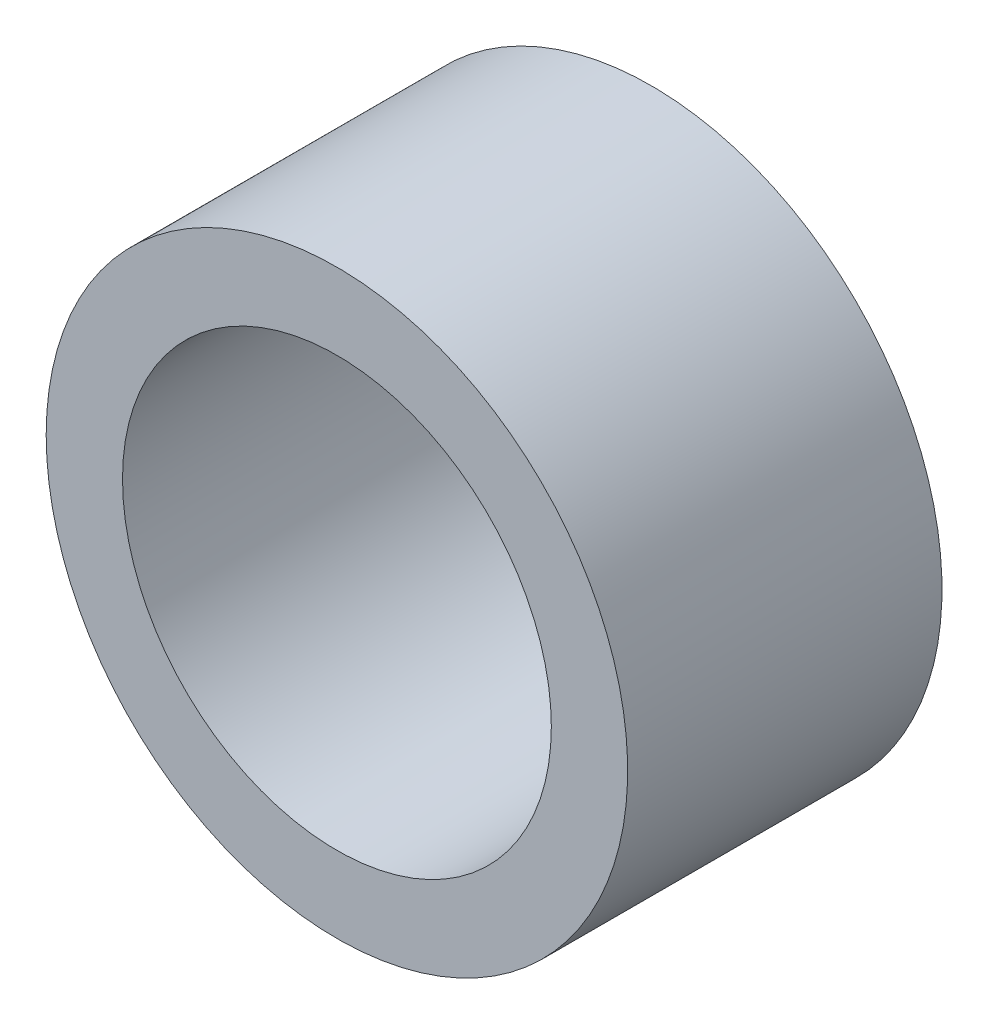
ISO-10303-21;
HEADER;
FILE_DESCRIPTION(('STEP AP214'),'2;1');
FILE_NAME('part.step','',(''),(''),'','','');
FILE_SCHEMA(('AUTOMOTIVE_DESIGN { 1 0 10303 214 1 1 1 1 }'));
ENDSEC;
DATA;
#1=APPLICATION_CONTEXT('core data for automotive mechanical design processes');
#2=APPLICATION_PROTOCOL_DEFINITION('international standard','automotive_design',2000,#1);
#3=PRODUCT_CONTEXT('',#1,'mechanical');
#4=PRODUCT('Part','Part','',(#3));
#5=PRODUCT_RELATED_PRODUCT_CATEGORY('part','',(#4));
#6=PRODUCT_DEFINITION_FORMATION('','',#4);
#7=PRODUCT_DEFINITION_CONTEXT('part definition',#1,'design');
#8=PRODUCT_DEFINITION('design','',#6,#7);
#9=PRODUCT_DEFINITION_SHAPE('','',#8);
#10=(LENGTH_UNIT() NAMED_UNIT(*) SI_UNIT(.MILLI.,.METRE.));
#11=(NAMED_UNIT(*) PLANE_ANGLE_UNIT() SI_UNIT($,.RADIAN.));
#12=(NAMED_UNIT(*) SI_UNIT($,.STERADIAN.) SOLID_ANGLE_UNIT());
#13=UNCERTAINTY_MEASURE_WITH_UNIT(LENGTH_MEASURE(1.E-05),#10,'distance_accuracy_value','');
#14=(GEOMETRIC_REPRESENTATION_CONTEXT(3) GLOBAL_UNCERTAINTY_ASSIGNED_CONTEXT((#13)) GLOBAL_UNIT_ASSIGNED_CONTEXT((#10,
#11,#12)) REPRESENTATION_CONTEXT('',''));
#15=CARTESIAN_POINT('',(0.,0.,0.));
#16=DIRECTION('',(0.,0.,1.));
#17=DIRECTION('',(1.,0.,0.));
#18=AXIS2_PLACEMENT_3D('',#15,#16,#17);
#19=CARTESIAN_POINT('',(0.,0.,7.112));
#20=DIRECTION('',(0.,0.,-1.));
#21=DIRECTION('',(-1.,0.,0.));
#22=AXIS2_PLACEMENT_3D('',#19,#20,#21);
#23=CYLINDRICAL_SURFACE('',#22,4.8514);
#24=CARTESIAN_POINT('',(0.,0.,0.));
#25=DIRECTION('',(0.,0.,-1.));
#26=DIRECTION('',(-1.,0.,0.));
#27=AXIS2_PLACEMENT_3D('',#24,#25,#26);
#28=CIRCLE('',#27,4.8514);
#29=CARTESIAN_POINT('',(-4.8514,0.,0.));
#30=VERTEX_POINT('',#29);
#31=EDGE_CURVE('E28',#30,#30,#28,.T.);
#32=ORIENTED_EDGE('',*,*,#31,.T.);
#33=EDGE_LOOP('',(#32));
#34=FACE_BOUND('',#33,.T.);
#35=CARTESIAN_POINT('',(0.,0.,7.112));
#36=DIRECTION('',(0.,0.,-1.));
#37=DIRECTION('',(-1.,0.,0.));
#38=AXIS2_PLACEMENT_3D('',#35,#36,#37);
#39=CIRCLE('',#38,4.8514);
#40=CARTESIAN_POINT('',(-4.8514,0.,7.112));
#41=VERTEX_POINT('',#40);
#42=EDGE_CURVE('E19',#41,#41,#39,.T.);
#43=ORIENTED_EDGE('',*,*,#42,.F.);
#44=EDGE_LOOP('',(#43));
#45=FACE_BOUND('',#44,.T.);
#46=ADVANCED_FACE('F16',(#34,#45),#23,.F.);
#47=CARTESIAN_POINT('',(0.,0.,7.112));
#48=DIRECTION('',(0.,0.,1.));
#49=DIRECTION('',(1.,0.,0.));
#50=AXIS2_PLACEMENT_3D('',#47,#48,#49);
#51=PLANE('',#50);
#52=ORIENTED_EDGE('',*,*,#42,.T.);
#53=EDGE_LOOP('',(#52));
#54=FACE_BOUND('',#53,.T.);
#55=CARTESIAN_POINT('',(0.,0.,7.112));
#56=DIRECTION('',(0.,0.,-1.));
#57=DIRECTION('',(-1.,0.,0.));
#58=AXIS2_PLACEMENT_3D('',#55,#56,#57);
#59=CIRCLE('',#58,6.5786);
#60=CARTESIAN_POINT('',(-6.5786,0.,7.112));
#61=VERTEX_POINT('',#60);
#62=EDGE_CURVE('E23',#61,#61,#59,.T.);
#63=ORIENTED_EDGE('',*,*,#62,.F.);
#64=EDGE_LOOP('',(#63));
#65=FACE_BOUND('',#64,.T.);
#66=ADVANCED_FACE('F36',(#54,#65),#51,.T.);
#67=CARTESIAN_POINT('',(0.,0.,0.));
#68=DIRECTION('',(0.,0.,1.));
#69=DIRECTION('',(1.,0.,0.));
#70=AXIS2_PLACEMENT_3D('',#67,#68,#69);
#71=PLANE('',#70);
#72=ORIENTED_EDGE('',*,*,#31,.F.);
#73=EDGE_LOOP('',(#72));
#74=FACE_BOUND('',#73,.T.);
#75=CARTESIAN_POINT('',(0.,0.,0.));
#76=DIRECTION('',(0.,0.,-1.));
#77=DIRECTION('',(-1.,0.,0.));
#78=AXIS2_PLACEMENT_3D('',#75,#76,#77);
#79=CIRCLE('',#78,6.5786);
#80=CARTESIAN_POINT('',(-6.5786,0.,0.));
#81=VERTEX_POINT('',#80);
#82=EDGE_CURVE('E10',#81,#81,#79,.F.);
#83=ORIENTED_EDGE('',*,*,#82,.F.);
#84=EDGE_LOOP('',(#83));
#85=FACE_BOUND('',#84,.T.);
#86=ADVANCED_FACE('F43',(#74,#85),#71,.F.);
#87=CARTESIAN_POINT('',(0.,0.,7.112));
#88=DIRECTION('',(0.,0.,-1.));
#89=DIRECTION('',(-1.,0.,0.));
#90=AXIS2_PLACEMENT_3D('',#87,#88,#89);
#91=CYLINDRICAL_SURFACE('',#90,6.5786);
#92=ORIENTED_EDGE('',*,*,#82,.T.);
#93=EDGE_LOOP('',(#92));
#94=FACE_BOUND('',#93,.T.);
#95=ORIENTED_EDGE('',*,*,#62,.T.);
#96=EDGE_LOOP('',(#95));
#97=FACE_BOUND('',#96,.T.);
#98=ADVANCED_FACE('F44',(#94,#97),#91,.T.);
#99=CLOSED_SHELL('',(#46,#66,#86,#98));
#100=MANIFOLD_SOLID_BREP('B1',#99);
#101=ADVANCED_BREP_SHAPE_REPRESENTATION('',(#18,#100),#14);
#102=SHAPE_DEFINITION_REPRESENTATION(#9,#101);
ENDSEC;
END-ISO-10303-21;
